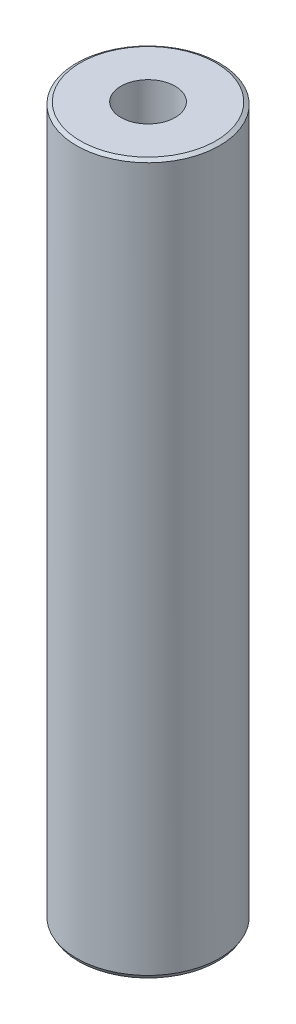
ISO-10303-21;
HEADER;
FILE_DESCRIPTION(('STEP AP214'),'2;1');
FILE_NAME('part.step','',(''),(''),'','','');
FILE_SCHEMA(('AUTOMOTIVE_DESIGN { 1 0 10303 214 1 1 1 1 }'));
ENDSEC;
DATA;
#1=APPLICATION_CONTEXT('core data for automotive mechanical design processes');
#2=APPLICATION_PROTOCOL_DEFINITION('international standard','automotive_design',2000,#1);
#3=PRODUCT_CONTEXT('',#1,'mechanical');
#4=PRODUCT('Part','Part','',(#3));
#5=PRODUCT_RELATED_PRODUCT_CATEGORY('part','',(#4));
#6=PRODUCT_DEFINITION_FORMATION('','',#4);
#7=PRODUCT_DEFINITION_CONTEXT('part definition',#1,'design');
#8=PRODUCT_DEFINITION('design','',#6,#7);
#9=PRODUCT_DEFINITION_SHAPE('','',#8);
#10=(LENGTH_UNIT() NAMED_UNIT(*) SI_UNIT(.MILLI.,.METRE.));
#11=(NAMED_UNIT(*) PLANE_ANGLE_UNIT() SI_UNIT($,.RADIAN.));
#12=(NAMED_UNIT(*) SI_UNIT($,.STERADIAN.) SOLID_ANGLE_UNIT());
#13=UNCERTAINTY_MEASURE_WITH_UNIT(LENGTH_MEASURE(1.E-05),#10,'distance_accuracy_value','');
#14=(GEOMETRIC_REPRESENTATION_CONTEXT(3) GLOBAL_UNCERTAINTY_ASSIGNED_CONTEXT((#13)) GLOBAL_UNIT_ASSIGNED_CONTEXT((#10,
#11,#12)) REPRESENTATION_CONTEXT('',''));
#15=CARTESIAN_POINT('',(0.,0.,0.));
#16=DIRECTION('',(0.,0.,1.));
#17=DIRECTION('',(1.,0.,0.));
#18=AXIS2_PLACEMENT_3D('',#15,#16,#17);
#19=CARTESIAN_POINT('',(0.,371.956406027411,0.));
#20=DIRECTION('',(0.,-1.,0.));
#21=DIRECTION('',(0.,0.,-1.));
#22=AXIS2_PLACEMENT_3D('',#19,#20,#21);
#23=CYLINDRICAL_SURFACE('',#22,37.5);
#24=CARTESIAN_POINT('',(0.,370.799370492253,0.));
#25=DIRECTION('',(0.,1.,0.));
#26=DIRECTION('',(0.,0.,1.));
#27=AXIS2_PLACEMENT_3D('',#24,#25,#26);
#28=CIRCLE('',#27,37.5);
#29=CARTESIAN_POINT('',(0.,370.799370492253,-37.5000000000001));
#30=VERTEX_POINT('',#29);
#31=EDGE_CURVE('E50',#30,#30,#28,.F.);
#32=ORIENTED_EDGE('',*,*,#31,.T.);
#33=EDGE_LOOP('',(#32));
#34=FACE_BOUND('',#33,.T.);
#35=CARTESIAN_POINT('',(0.,2.0040443330569,0.));
#36=DIRECTION('',(0.,1.,0.));
#37=DIRECTION('',(0.,0.,1.));
#38=AXIS2_PLACEMENT_3D('',#35,#36,#37);
#39=CIRCLE('',#38,37.5);
#40=CARTESIAN_POINT('',(0.,2.0040443330569,37.5));
#41=VERTEX_POINT('',#40);
#42=EDGE_CURVE('E51',#41,#41,#39,.T.);
#43=ORIENTED_EDGE('',*,*,#42,.T.);
#44=EDGE_LOOP('',(#43));
#45=FACE_BOUND('',#44,.T.);
#46=ADVANCED_FACE('F39',(#34,#45),#23,.T.);
#47=CARTESIAN_POINT('',(0.,371.956406027411,0.));
#48=DIRECTION('',(0.,1.,0.));
#49=DIRECTION('',(0.,0.,1.));
#50=AXIS2_PLACEMENT_3D('',#47,#48,#49);
#51=PLANE('',#50);
#52=CARTESIAN_POINT('',(0.,371.956406027411,0.));
#53=DIRECTION('',(0.,1.,0.));
#54=DIRECTION('',(0.,0.,1.));
#55=AXIS2_PLACEMENT_3D('',#52,#53,#54);
#56=CIRCLE('',#55,35.4959556669429);
#57=CARTESIAN_POINT('',(0.,371.956406027411,-35.495955666943));
#58=VERTEX_POINT('',#57);
#59=EDGE_CURVE('E54',#58,#58,#56,.T.);
#60=ORIENTED_EDGE('',*,*,#59,.T.);
#61=EDGE_LOOP('',(#60));
#62=FACE_BOUND('',#61,.T.);
#63=CARTESIAN_POINT('',(0.,371.956406027411,0.));
#64=DIRECTION('',(0.,1.,0.));
#65=DIRECTION('',(0.,0.,1.));
#66=AXIS2_PLACEMENT_3D('',#63,#64,#65);
#67=CIRCLE('',#66,14.2294831717841);
#68=CARTESIAN_POINT('',(0.,371.956406027411,14.2294831717841));
#69=VERTEX_POINT('',#68);
#70=EDGE_CURVE('E58',#69,#69,#67,.T.);
#71=ORIENTED_EDGE('',*,*,#70,.F.);
#72=EDGE_LOOP('',(#71));
#73=FACE_BOUND('',#72,.T.);
#74=ADVANCED_FACE('F69',(#62,#73),#51,.T.);
#75=CARTESIAN_POINT('',(0.,0.,0.));
#76=DIRECTION('',(0.,1.,0.));
#77=DIRECTION('',(0.,0.,1.));
#78=AXIS2_PLACEMENT_3D('',#75,#76,#77);
#79=PLANE('',#78);
#80=CARTESIAN_POINT('',(0.,0.,0.));
#81=DIRECTION('',(0.,1.,0.));
#82=DIRECTION('',(0.,0.,1.));
#83=AXIS2_PLACEMENT_3D('',#80,#81,#82);
#84=CIRCLE('',#83,36.3429644648416);
#85=CARTESIAN_POINT('',(0.,0.,36.3429644648416));
#86=VERTEX_POINT('',#85);
#87=EDGE_CURVE('E10',#86,#86,#84,.F.);
#88=ORIENTED_EDGE('',*,*,#87,.T.);
#89=EDGE_LOOP('',(#88));
#90=FACE_BOUND('',#89,.T.);
#91=CARTESIAN_POINT('',(0.,0.,0.));
#92=DIRECTION('',(0.,1.,0.));
#93=DIRECTION('',(0.,0.,1.));
#94=AXIS2_PLACEMENT_3D('',#91,#92,#93);
#95=CIRCLE('',#94,14.2294831717841);
#96=CARTESIAN_POINT('',(0.,0.,14.2294831717841));
#97=VERTEX_POINT('',#96);
#98=EDGE_CURVE('E63',#97,#97,#95,.T.);
#99=ORIENTED_EDGE('',*,*,#98,.T.);
#100=EDGE_LOOP('',(#99));
#101=FACE_BOUND('',#100,.T.);
#102=ADVANCED_FACE('F75',(#90,#101),#79,.F.);
#103=CARTESIAN_POINT('',(0.,371.956406027411,0.));
#104=DIRECTION('',(0.,-1.,0.));
#105=DIRECTION('',(0.,0.,-1.));
#106=AXIS2_PLACEMENT_3D('',#103,#104,#105);
#107=CYLINDRICAL_SURFACE('',#106,14.2294831717841);
#108=ORIENTED_EDGE('',*,*,#70,.T.);
#109=EDGE_LOOP('',(#108));
#110=FACE_BOUND('',#109,.T.);
#111=ORIENTED_EDGE('',*,*,#98,.F.);
#112=EDGE_LOOP('',(#111));
#113=FACE_BOUND('',#112,.T.);
#114=ADVANCED_FACE('F70',(#110,#113),#107,.F.);
#115=CARTESIAN_POINT('',(0.,371.956406027411,0.));
#116=DIRECTION('',(0.,-1.,0.));
#117=DIRECTION('',(0.,0.,-1.));
#118=AXIS2_PLACEMENT_3D('',#115,#116,#117);
#119=CONICAL_SURFACE('',#118,35.4959556669429,1.04719755119658);
#120=CARTESIAN_POINT('',(0.,370.799370492253,-37.5000000000001));
#121=CARTESIAN_POINT('',(0.,370.811422945744,-37.4791245381974));
#122=CARTESIAN_POINT('',(0.,370.823475399235,-37.4582490763947));
#123=CARTESIAN_POINT('',(0.,370.847580306218,-37.4164981527893));
#124=CARTESIAN_POINT('',(0.,370.859632759709,-37.3956226909867));
#125=CARTESIAN_POINT('',(0.,370.883737666691,-37.3538717673813));
#126=CARTESIAN_POINT('',(0.,370.895790120182,-37.3329963055786));
#127=CARTESIAN_POINT('',(0.,370.919895027165,-37.2912453819733));
#128=CARTESIAN_POINT('',(0.,370.931947480656,-37.2703699201706));
#129=CARTESIAN_POINT('',(0.,370.956052387639,-37.2286189965652));
#130=CARTESIAN_POINT('',(0.,370.96810484113,-37.2077435347626));
#131=CARTESIAN_POINT('',(0.,370.992209748112,-37.1659926111572));
#132=CARTESIAN_POINT('',(0.,371.004262201604,-37.1451171493545));
#133=CARTESIAN_POINT('',(0.,371.028367108586,-37.1033662257492));
#134=CARTESIAN_POINT('',(0.,371.040419562077,-37.0824907639465));
#135=CARTESIAN_POINT('',(0.,371.06452446906,-37.0407398403411));
#136=CARTESIAN_POINT('',(0.,371.076576922551,-37.0198643785385));
#137=CARTESIAN_POINT('',(0.,371.100681829533,-36.9781134549331));
#138=CARTESIAN_POINT('',(0.,371.112734283025,-36.9572379931304));
#139=CARTESIAN_POINT('',(0.,371.136839190007,-36.9154870695251));
#140=CARTESIAN_POINT('',(0.,371.148891643498,-36.8946116077224));
#141=CARTESIAN_POINT('',(0.,371.172996550481,-36.852860684117));
#142=CARTESIAN_POINT('',(0.,371.185049003972,-36.8319852223144));
#143=CARTESIAN_POINT('',(0.,371.209153910955,-36.790234298709));
#144=CARTESIAN_POINT('',(0.,371.221206364446,-36.7693588369063));
#145=CARTESIAN_POINT('',(0.,371.245311271428,-36.727607913301));
#146=CARTESIAN_POINT('',(0.,371.25736372492,-36.7067324514983));
#147=CARTESIAN_POINT('',(0.,371.281468631902,-36.6649815278929));
#148=CARTESIAN_POINT('',(0.,371.293521085393,-36.6441060660903));
#149=CARTESIAN_POINT('',(0.,371.317625992376,-36.6023551424849));
#150=CARTESIAN_POINT('',(0.,371.329678445867,-36.5814796806822));
#151=CARTESIAN_POINT('',(0.,371.353783352849,-36.5397287570769));
#152=CARTESIAN_POINT('',(0.,371.365835806341,-36.5188532952742));
#153=CARTESIAN_POINT('',(0.,371.389940713323,-36.4771023716688));
#154=CARTESIAN_POINT('',(0.,371.401993166814,-36.4562269098661));
#155=CARTESIAN_POINT('',(0.,371.426098073797,-36.4144759862608));
#156=CARTESIAN_POINT('',(0.,371.438150527288,-36.3936005244581));
#157=CARTESIAN_POINT('',(0.,371.462255434271,-36.3518496008528));
#158=CARTESIAN_POINT('',(0.,371.474307887762,-36.3309741390501));
#159=CARTESIAN_POINT('',(0.,371.498412794744,-36.2892232154447));
#160=CARTESIAN_POINT('',(0.,371.510465248235,-36.268347753642));
#161=CARTESIAN_POINT('',(0.,371.534570155218,-36.2265968300367));
#162=CARTESIAN_POINT('',(0.,371.546622608709,-36.205721368234));
#163=CARTESIAN_POINT('',(0.,371.570727515692,-36.1639704446287));
#164=CARTESIAN_POINT('',(0.,371.582779969183,-36.143094982826));
#165=CARTESIAN_POINT('',(0.,371.606884876165,-36.1013440592206));
#166=CARTESIAN_POINT('',(0.,371.618937329657,-36.080468597418));
#167=CARTESIAN_POINT('',(0.,371.643042236639,-36.0387176738126));
#168=CARTESIAN_POINT('',(0.,371.65509469013,-36.0178422120099));
#169=CARTESIAN_POINT('',(0.,371.679199597113,-35.9760912884046));
#170=CARTESIAN_POINT('',(0.,371.691252050604,-35.9552158266019));
#171=CARTESIAN_POINT('',(0.,371.715356957586,-35.9134649029965));
#172=CARTESIAN_POINT('',(0.,371.727409411078,-35.8925894411938));
#173=CARTESIAN_POINT('',(0.,371.75151431806,-35.8508385175885));
#174=CARTESIAN_POINT('',(0.,371.763566771551,-35.8299630557858));
#175=CARTESIAN_POINT('',(0.,371.787671678534,-35.7882121321805));
#176=CARTESIAN_POINT('',(0.,371.799724132025,-35.7673366703778));
#177=CARTESIAN_POINT('',(0.,371.823829039008,-35.7255857467724));
#178=CARTESIAN_POINT('',(0.,371.835881492499,-35.7047102849697));
#179=CARTESIAN_POINT('',(0.,371.859986399481,-35.6629593613644));
#180=CARTESIAN_POINT('',(0.,371.872038852972,-35.6420838995617));
#181=CARTESIAN_POINT('',(0.,371.896143759955,-35.6003329759563));
#182=CARTESIAN_POINT('',(0.,371.908196213446,-35.5794575141537));
#183=CARTESIAN_POINT('',(0.,371.932301120429,-35.5377065905483));
#184=CARTESIAN_POINT('',(0.,371.94435357392,-35.5168311287456));
#185=CARTESIAN_POINT('',(0.,371.956406027411,-35.495955666943));
#186=B_SPLINE_CURVE_WITH_KNOTS('',3,(#120,#121,#122,#123,#124,#125,#126,#127,#128,#129,#130,
#131,#132,#133,#134,#135,#136,#137,#138,#139,#140,#141,#142,#143,#144,#145,#146,#147,#148,#149,
#150,#151,#152,#153,#154,#155,#156,#157,#158,#159,#160,#161,#162,#163,#164,#165,#166,#167,#168,
#169,#170,#171,#172,#173,#174,#175,#176,#177,#178,#179,#180,#181,#182,#183,#184,#185),
.UNSPECIFIED.,.F.,.F.,(4,2,2,2,2,2,2,2,2,2,2,2,2,2,2,2,2,2,2,2,2,2,2,2,2,2,2,2,2,2,2,2,4),(0.,
0.0723147209474249,0.144629441894822,0.216944162842219,0.289258883789638,0.361573604737035,
0.433888325684432,0.50620304663183,0.578517767579254,0.650832488526652,0.723147209474049,
0.795461930421474,0.867776651368871,0.940091372316262,1.01240609326366,1.08472081421108,
1.15703553515848,1.22935025610588,1.3016649770533,1.3739796980007,1.4462944189481,
1.51860913989549,1.59092386084291,1.66323858179031,1.73555330273771,1.80786802368513,
1.88018274463253,1.95249746557993,2.02481218652733,2.09712690747474,2.16944162842214,
2.24175634936954,2.31407107031696),.UNSPECIFIED.);
#187=EDGE_CURVE('BSEAM81',#30,#58,#186,.T.);
#188=ORIENTED_EDGE('',*,*,#31,.F.);
#189=ORIENTED_EDGE('',*,*,#59,.F.);
#190=ORIENTED_EDGE('',*,*,#187,.T.);
#191=ORIENTED_EDGE('',*,*,#187,.F.);
#192=EDGE_LOOP('',(#188,#190,#189,#191));
#193=FACE_BOUND('',#192,.T.);
#194=ADVANCED_FACE('F81',(#193),#119,.T.);
#195=CARTESIAN_POINT('',(0.,2.0040443330569,0.));
#196=DIRECTION('',(0.,1.,0.));
#197=DIRECTION('',(0.,0.,1.));
#198=AXIS2_PLACEMENT_3D('',#195,#196,#197);
#199=CONICAL_SURFACE('',#198,37.5,0.523598775598306);
#200=ORIENTED_EDGE('',*,*,#87,.F.);
#201=EDGE_LOOP('',(#200));
#202=FACE_BOUND('',#201,.T.);
#203=ORIENTED_EDGE('',*,*,#42,.F.);
#204=EDGE_LOOP('',(#203));
#205=FACE_BOUND('',#204,.T.);
#206=ADVANCED_FACE('F45',(#202,#205),#199,.T.);
#207=CLOSED_SHELL('',(#46,#74,#102,#114,#194,#206));
#208=MANIFOLD_SOLID_BREP('B2',#207);
#209=ADVANCED_BREP_SHAPE_REPRESENTATION('',(#18,#208),#14);
#210=SHAPE_DEFINITION_REPRESENTATION(#9,#209);
ENDSEC;
END-ISO-10303-21;
